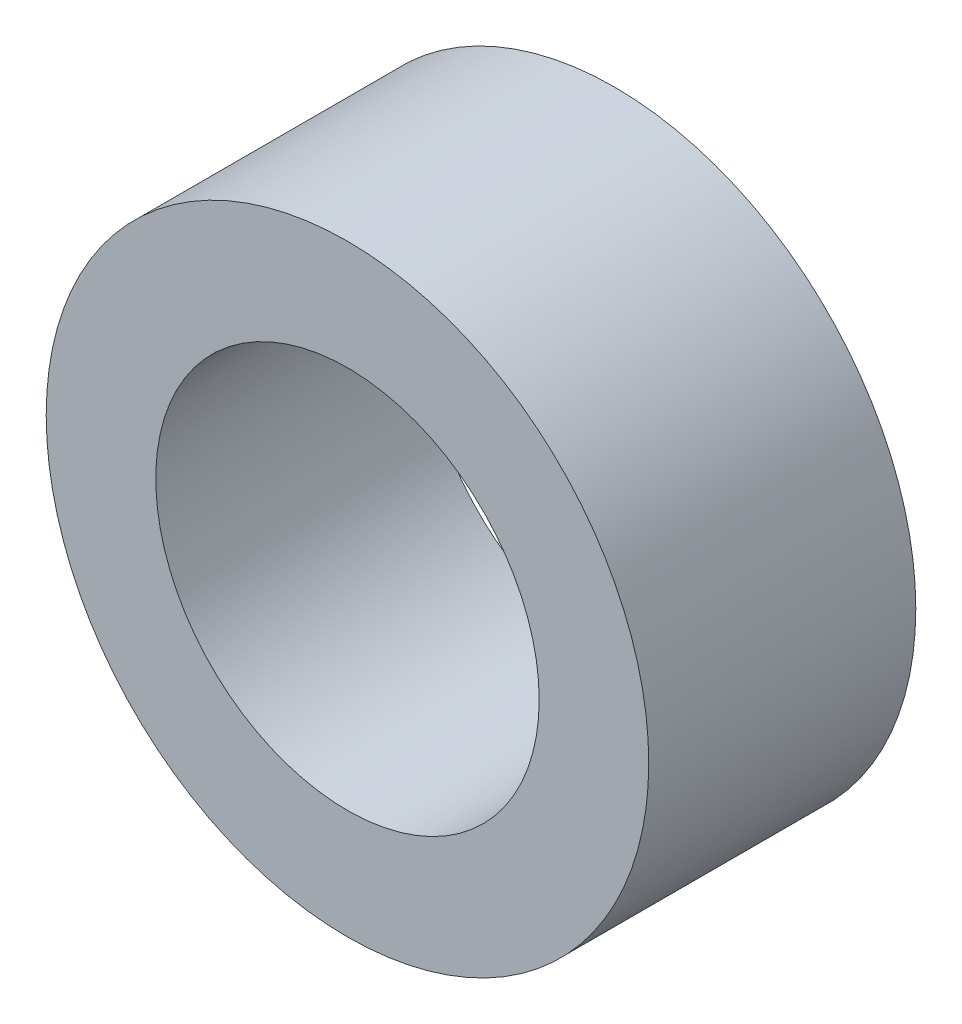
ISO-10303-21;
HEADER;
FILE_DESCRIPTION(('STEP AP214'),'2;1');
FILE_NAME('part.step','',(''),(''),'','','');
FILE_SCHEMA(('AUTOMOTIVE_DESIGN { 1 0 10303 214 1 1 1 1 }'));
ENDSEC;
DATA;
#1=APPLICATION_CONTEXT('core data for automotive mechanical design processes');
#2=APPLICATION_PROTOCOL_DEFINITION('international standard','automotive_design',2000,#1);
#3=PRODUCT_CONTEXT('',#1,'mechanical');
#4=PRODUCT('Part','Part','',(#3));
#5=PRODUCT_RELATED_PRODUCT_CATEGORY('part','',(#4));
#6=PRODUCT_DEFINITION_FORMATION('','',#4);
#7=PRODUCT_DEFINITION_CONTEXT('part definition',#1,'design');
#8=PRODUCT_DEFINITION('design','',#6,#7);
#9=PRODUCT_DEFINITION_SHAPE('','',#8);
#10=(LENGTH_UNIT() NAMED_UNIT(*) SI_UNIT(.MILLI.,.METRE.));
#11=(NAMED_UNIT(*) PLANE_ANGLE_UNIT() SI_UNIT($,.RADIAN.));
#12=(NAMED_UNIT(*) SI_UNIT($,.STERADIAN.) SOLID_ANGLE_UNIT());
#13=UNCERTAINTY_MEASURE_WITH_UNIT(LENGTH_MEASURE(1.E-05),#10,'distance_accuracy_value','');
#14=(GEOMETRIC_REPRESENTATION_CONTEXT(3) GLOBAL_UNCERTAINTY_ASSIGNED_CONTEXT((#13)) GLOBAL_UNIT_ASSIGNED_CONTEXT((#10,
#11,#12)) REPRESENTATION_CONTEXT('',''));
#15=CARTESIAN_POINT('',(0.,0.,0.));
#16=DIRECTION('',(0.,0.,1.));
#17=DIRECTION('',(1.,0.,0.));
#18=AXIS2_PLACEMENT_3D('',#15,#16,#17);
#19=CARTESIAN_POINT('',(0.,0.,39.));
#20=DIRECTION('',(0.,0.,1.));
#21=DIRECTION('',(1.,0.,0.));
#22=AXIS2_PLACEMENT_3D('',#19,#20,#21);
#23=PLANE('',#22);
#24=CARTESIAN_POINT('',(0.,0.,39.));
#25=DIRECTION('',(0.,0.,1.));
#26=DIRECTION('',(1.,0.,0.));
#27=AXIS2_PLACEMENT_3D('',#24,#25,#26);
#28=CIRCLE('',#27,44.);
#29=CARTESIAN_POINT('',(44.,0.,39.));
#30=VERTEX_POINT('',#29);
#31=EDGE_CURVE('E10',#30,#30,#28,.T.);
#32=ORIENTED_EDGE('',*,*,#31,.T.);
#33=EDGE_LOOP('',(#32));
#34=FACE_BOUND('',#33,.T.);
#35=CARTESIAN_POINT('',(0.,0.,39.));
#36=DIRECTION('',(0.,0.,1.));
#37=DIRECTION('',(1.,0.,0.));
#38=AXIS2_PLACEMENT_3D('',#35,#36,#37);
#39=CIRCLE('',#38,28.);
#40=CARTESIAN_POINT('',(28.,0.,39.));
#41=VERTEX_POINT('',#40);
#42=EDGE_CURVE('E54',#41,#41,#39,.T.);
#43=ORIENTED_EDGE('',*,*,#42,.F.);
#44=EDGE_LOOP('',(#43));
#45=FACE_BOUND('',#44,.T.);
#46=ADVANCED_FACE('F41',(#34,#45),#23,.T.);
#47=CARTESIAN_POINT('',(0.,0.,0.));
#48=DIRECTION('',(0.,0.,1.));
#49=DIRECTION('',(1.,0.,0.));
#50=AXIS2_PLACEMENT_3D('',#47,#48,#49);
#51=PLANE('',#50);
#52=CARTESIAN_POINT('',(0.,0.,0.));
#53=DIRECTION('',(0.,0.,1.));
#54=DIRECTION('',(1.,0.,0.));
#55=AXIS2_PLACEMENT_3D('',#52,#53,#54);
#56=CIRCLE('',#55,44.);
#57=CARTESIAN_POINT('',(44.,0.,0.));
#58=VERTEX_POINT('',#57);
#59=EDGE_CURVE('E45',#58,#58,#56,.T.);
#60=ORIENTED_EDGE('',*,*,#59,.F.);
#61=EDGE_LOOP('',(#60));
#62=FACE_BOUND('',#61,.T.);
#63=CARTESIAN_POINT('',(0.,0.,0.));
#64=DIRECTION('',(0.,0.,1.));
#65=DIRECTION('',(1.,0.,0.));
#66=AXIS2_PLACEMENT_3D('',#63,#64,#65);
#67=CIRCLE('',#66,28.);
#68=CARTESIAN_POINT('',(28.,0.,0.));
#69=VERTEX_POINT('',#68);
#70=EDGE_CURVE('E56',#69,#69,#67,.T.);
#71=ORIENTED_EDGE('',*,*,#70,.T.);
#72=EDGE_LOOP('',(#71));
#73=FACE_BOUND('',#72,.T.);
#74=ADVANCED_FACE('F68',(#62,#73),#51,.F.);
#75=CARTESIAN_POINT('',(0.,0.,39.));
#76=DIRECTION('',(0.,0.,-1.));
#77=DIRECTION('',(-1.,0.,0.));
#78=AXIS2_PLACEMENT_3D('',#75,#76,#77);
#79=CYLINDRICAL_SURFACE('',#78,44.);
#80=ORIENTED_EDGE('',*,*,#31,.F.);
#81=EDGE_LOOP('',(#80));
#82=FACE_BOUND('',#81,.T.);
#83=ORIENTED_EDGE('',*,*,#59,.T.);
#84=EDGE_LOOP('',(#83));
#85=FACE_BOUND('',#84,.T.);
#86=ADVANCED_FACE('F43',(#82,#85),#79,.T.);
#87=CARTESIAN_POINT('',(0.,0.,39.));
#88=DIRECTION('',(0.,0.,-1.));
#89=DIRECTION('',(-1.,0.,0.));
#90=AXIS2_PLACEMENT_3D('',#87,#88,#89);
#91=CYLINDRICAL_SURFACE('',#90,28.);
#92=ORIENTED_EDGE('',*,*,#42,.T.);
#93=EDGE_LOOP('',(#92));
#94=FACE_BOUND('',#93,.T.);
#95=ORIENTED_EDGE('',*,*,#70,.F.);
#96=EDGE_LOOP('',(#95));
#97=FACE_BOUND('',#96,.T.);
#98=ADVANCED_FACE('F64',(#94,#97),#91,.F.);
#99=CLOSED_SHELL('',(#46,#74,#86,#98));
#100=MANIFOLD_SOLID_BREP('B2',#99);
#101=ADVANCED_BREP_SHAPE_REPRESENTATION('',(#18,#100),#14);
#102=SHAPE_DEFINITION_REPRESENTATION(#9,#101);
ENDSEC;
END-ISO-10303-21;
